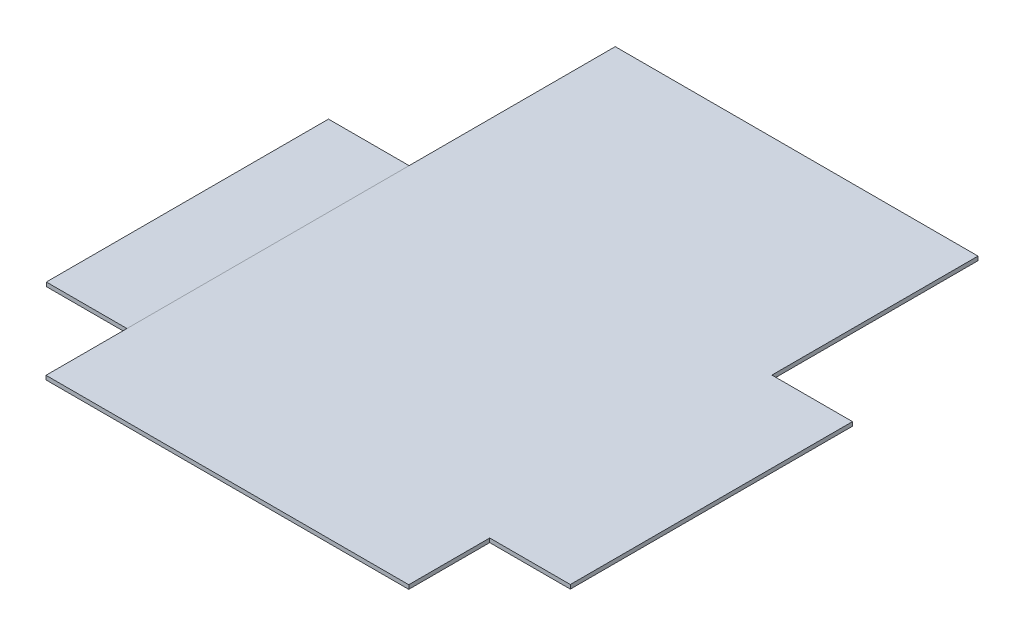
ISO-10303-21;
HEADER;
FILE_DESCRIPTION(('STEP AP214'),'2;1');
FILE_NAME('part.step','',(''),(''),'','','');
FILE_SCHEMA(('AUTOMOTIVE_DESIGN { 1 0 10303 214 1 1 1 1 }'));
ENDSEC;
DATA;
#1=APPLICATION_CONTEXT('core data for automotive mechanical design processes');
#2=APPLICATION_PROTOCOL_DEFINITION('international standard','automotive_design',2000,#1);
#3=PRODUCT_CONTEXT('',#1,'mechanical');
#4=PRODUCT('Part','Part','',(#3));
#5=PRODUCT_RELATED_PRODUCT_CATEGORY('part','',(#4));
#6=PRODUCT_DEFINITION_FORMATION('','',#4);
#7=PRODUCT_DEFINITION_CONTEXT('part definition',#1,'design');
#8=PRODUCT_DEFINITION('design','',#6,#7);
#9=PRODUCT_DEFINITION_SHAPE('','',#8);
#10=(LENGTH_UNIT() NAMED_UNIT(*) SI_UNIT(.MILLI.,.METRE.));
#11=(NAMED_UNIT(*) PLANE_ANGLE_UNIT() SI_UNIT($,.RADIAN.));
#12=(NAMED_UNIT(*) SI_UNIT($,.STERADIAN.) SOLID_ANGLE_UNIT());
#13=UNCERTAINTY_MEASURE_WITH_UNIT(LENGTH_MEASURE(1.E-05),#10,'distance_accuracy_value','');
#14=(GEOMETRIC_REPRESENTATION_CONTEXT(3) GLOBAL_UNCERTAINTY_ASSIGNED_CONTEXT((#13)) GLOBAL_UNIT_ASSIGNED_CONTEXT((#10,
#11,#12)) REPRESENTATION_CONTEXT('',''));
#15=CARTESIAN_POINT('',(0.,0.,0.));
#16=DIRECTION('',(0.,0.,1.));
#17=DIRECTION('',(1.,0.,0.));
#18=AXIS2_PLACEMENT_3D('',#15,#16,#17);
#19=CARTESIAN_POINT('',(-40.,-2.,0.));
#20=DIRECTION('',(0.,0.,-1.));
#21=DIRECTION('',(-1.,0.,0.));
#22=AXIS2_PLACEMENT_3D('',#19,#20,#21);
#23=PLANE('',#22);
#24=DIRECTION('',(0.,1.,0.));
#25=VECTOR('',#24,1.);
#26=CARTESIAN_POINT('',(0.,-2.,0.));
#27=LINE('',#26,#25);
#28=CARTESIAN_POINT('',(0.,-2.,0.));
#29=VERTEX_POINT('',#28);
#30=CARTESIAN_POINT('',(0.,0.,0.));
#31=VERTEX_POINT('',#30);
#32=EDGE_CURVE('E250',#29,#31,#27,.T.);
#33=ORIENTED_EDGE('',*,*,#32,.T.);
#34=DIRECTION('',(1.,0.,0.));
#35=VECTOR('',#34,1.);
#36=CARTESIAN_POINT('',(-40.,0.,0.));
#37=LINE('',#36,#35);
#38=CARTESIAN_POINT('',(-40.,0.,0.));
#39=VERTEX_POINT('',#38);
#40=EDGE_CURVE('E14',#39,#31,#37,.T.);
#41=ORIENTED_EDGE('',*,*,#40,.F.);
#42=DIRECTION('',(0.,1.,0.));
#43=VECTOR('',#42,1.);
#44=CARTESIAN_POINT('',(-40.,-2.,0.));
#45=LINE('',#44,#43);
#46=CARTESIAN_POINT('',(-40.,-2.,0.));
#47=VERTEX_POINT('',#46);
#48=EDGE_CURVE('E238',#47,#39,#45,.T.);
#49=ORIENTED_EDGE('',*,*,#48,.F.);
#50=DIRECTION('',(1.,0.,0.));
#51=VECTOR('',#50,1.);
#52=CARTESIAN_POINT('',(-40.,-2.,0.));
#53=LINE('',#52,#51);
#54=EDGE_CURVE('E246',#47,#29,#53,.T.);
#55=ORIENTED_EDGE('',*,*,#54,.T.);
#56=EDGE_LOOP('',(#33,#41,#49,#55));
#57=FACE_BOUND('',#56,.T.);
#58=ADVANCED_FACE('F187',(#57),#23,.F.);
#59=CARTESIAN_POINT('',(-40.,0.,0.));
#60=DIRECTION('',(0.,-1.,0.));
#61=DIRECTION('',(0.,0.,-1.));
#62=AXIS2_PLACEMENT_3D('',#59,#60,#61);
#63=PLANE('',#62);
#64=DIRECTION('',(0.,0.,-1.));
#65=VECTOR('',#64,1.);
#66=CARTESIAN_POINT('',(0.,0.,0.));
#67=LINE('',#66,#65);
#68=CARTESIAN_POINT('',(0.,0.,-140.));
#69=VERTEX_POINT('',#68);
#70=EDGE_CURVE('E242',#31,#69,#67,.T.);
#71=ORIENTED_EDGE('',*,*,#70,.T.);
#72=DIRECTION('',(1.,0.,0.));
#73=VECTOR('',#72,1.);
#74=CARTESIAN_POINT('',(-40.,0.,-140.));
#75=LINE('',#74,#73);
#76=CARTESIAN_POINT('',(-40.,0.,-140.));
#77=VERTEX_POINT('',#76);
#78=EDGE_CURVE('E195',#77,#69,#75,.T.);
#79=ORIENTED_EDGE('',*,*,#78,.F.);
#80=DIRECTION('',(0.,0.,-1.));
#81=VECTOR('',#80,1.);
#82=CARTESIAN_POINT('',(-40.,0.,0.));
#83=LINE('',#82,#81);
#84=EDGE_CURVE('E233',#39,#77,#83,.T.);
#85=ORIENTED_EDGE('',*,*,#84,.F.);
#86=ORIENTED_EDGE('',*,*,#40,.T.);
#87=EDGE_LOOP('',(#71,#79,#85,#86));
#88=FACE_BOUND('',#87,.T.);
#89=ADVANCED_FACE('F241',(#88),#63,.F.);
#90=CARTESIAN_POINT('',(-40.,0.,-140.));
#91=DIRECTION('',(0.,0.,1.));
#92=DIRECTION('',(1.,0.,0.));
#93=AXIS2_PLACEMENT_3D('',#90,#91,#92);
#94=PLANE('',#93);
#95=DIRECTION('',(0.,-1.,0.));
#96=VECTOR('',#95,1.);
#97=CARTESIAN_POINT('',(0.,0.,-140.));
#98=LINE('',#97,#96);
#99=CARTESIAN_POINT('',(0.,-2.,-140.));
#100=VERTEX_POINT('',#99);
#101=EDGE_CURVE('E220',#69,#100,#98,.T.);
#102=ORIENTED_EDGE('',*,*,#101,.T.);
#103=DIRECTION('',(1.,0.,0.));
#104=VECTOR('',#103,1.);
#105=CARTESIAN_POINT('',(-40.,-2.,-140.));
#106=LINE('',#105,#104);
#107=CARTESIAN_POINT('',(-40.,-2.,-140.));
#108=VERTEX_POINT('',#107);
#109=EDGE_CURVE('E243',#108,#100,#106,.T.);
#110=ORIENTED_EDGE('',*,*,#109,.F.);
#111=DIRECTION('',(0.,-1.,0.));
#112=VECTOR('',#111,1.);
#113=CARTESIAN_POINT('',(-40.,0.,-140.));
#114=LINE('',#113,#112);
#115=EDGE_CURVE('E236',#77,#108,#114,.T.);
#116=ORIENTED_EDGE('',*,*,#115,.F.);
#117=ORIENTED_EDGE('',*,*,#78,.T.);
#118=EDGE_LOOP('',(#102,#110,#116,#117));
#119=FACE_BOUND('',#118,.T.);
#120=ADVANCED_FACE('F244',(#119),#94,.F.);
#121=CARTESIAN_POINT('',(-40.,-2.,-140.));
#122=DIRECTION('',(0.,1.,0.));
#123=DIRECTION('',(0.,0.,1.));
#124=AXIS2_PLACEMENT_3D('',#121,#122,#123);
#125=PLANE('',#124);
#126=DIRECTION('',(0.,0.,1.));
#127=VECTOR('',#126,1.);
#128=CARTESIAN_POINT('',(0.,-2.,-140.));
#129=LINE('',#128,#127);
#130=EDGE_CURVE('E226',#100,#29,#129,.T.);
#131=ORIENTED_EDGE('',*,*,#130,.T.);
#132=ORIENTED_EDGE('',*,*,#54,.F.);
#133=DIRECTION('',(0.,0.,1.));
#134=VECTOR('',#133,1.);
#135=CARTESIAN_POINT('',(-40.,-2.,-140.));
#136=LINE('',#135,#134);
#137=EDGE_CURVE('E203',#108,#47,#136,.T.);
#138=ORIENTED_EDGE('',*,*,#137,.F.);
#139=ORIENTED_EDGE('',*,*,#109,.T.);
#140=EDGE_LOOP('',(#131,#132,#138,#139));
#141=FACE_BOUND('',#140,.T.);
#142=ADVANCED_FACE('F257',(#141),#125,.F.);
#143=CARTESIAN_POINT('',(-40.,0.,0.));
#144=DIRECTION('',(-1.,0.,0.));
#145=DIRECTION('',(0.,0.,1.));
#146=AXIS2_PLACEMENT_3D('',#143,#144,#145);
#147=PLANE('',#146);
#148=ORIENTED_EDGE('',*,*,#48,.T.);
#149=ORIENTED_EDGE('',*,*,#84,.T.);
#150=ORIENTED_EDGE('',*,*,#115,.T.);
#151=ORIENTED_EDGE('',*,*,#137,.T.);
#152=EDGE_LOOP('',(#148,#149,#150,#151));
#153=FACE_BOUND('',#152,.T.);
#154=ADVANCED_FACE('F234',(#153),#147,.T.);
#155=CARTESIAN_POINT('',(0.,0.,0.));
#156=DIRECTION('',(-1.,0.,0.));
#157=DIRECTION('',(0.,0.,1.));
#158=AXIS2_PLACEMENT_3D('',#155,#156,#157);
#159=PLANE('',#158);
#160=ORIENTED_EDGE('',*,*,#32,.F.);
#161=ORIENTED_EDGE('',*,*,#130,.F.);
#162=ORIENTED_EDGE('',*,*,#101,.F.);
#163=ORIENTED_EDGE('',*,*,#70,.F.);
#164=EDGE_LOOP('',(#160,#161,#162,#163));
#165=FACE_BOUND('',#164,.T.);
#166=ADVANCED_FACE('F260',(#165),#159,.F.);
#167=CLOSED_SHELL('',(#58,#89,#120,#142,#154,#166));
#168=MANIFOLD_SOLID_BREP('B2_NOT_SHOWN',#167);
#169=CARTESIAN_POINT('',(0.,-2.00000000000028,-184.991244901112));
#170=DIRECTION('',(1.,0.,0.));
#171=DIRECTION('',(0.,-1.,0.));
#172=AXIS2_PLACEMENT_3D('',#169,#170,#171);
#173=PLANE('',#172);
#174=DIRECTION('',(0.,0.,1.));
#175=VECTOR('',#174,1.);
#176=CARTESIAN_POINT('',(0.,-2.77555756156289E-13,-184.991244901112));
#177=LINE('',#176,#175);
#178=CARTESIAN_POINT('',(0.,2.81025203108243E-13,40.176011873697));
#179=VERTEX_POINT('',#178);
#180=CARTESIAN_POINT('',(0.,-2.77555756156289E-13,-242.27631995365));
#181=VERTEX_POINT('',#180);
#182=EDGE_CURVE('E370',#179,#181,#177,.F.);
#183=ORIENTED_EDGE('',*,*,#182,.T.);
#184=DIRECTION('',(0.,-1.,0.));
#185=VECTOR('',#184,1.);
#186=CARTESIAN_POINT('',(0.,-3.05311331771918E-13,-242.27631995365));
#187=LINE('',#186,#185);
#188=CARTESIAN_POINT('',(0.,-2.00000000000028,-242.27631995365));
#189=VERTEX_POINT('',#188);
#190=EDGE_CURVE('E446',#181,#189,#187,.T.);
#191=ORIENTED_EDGE('',*,*,#190,.T.);
#192=DIRECTION('',(0.,0.,-1.));
#193=VECTOR('',#192,1.);
#194=CARTESIAN_POINT('',(0.,-2.,-141.991244901112));
#195=LINE('',#194,#193);
#196=CARTESIAN_POINT('',(0.,-1.99999999999972,40.176011873697));
#197=VERTEX_POINT('',#196);
#198=EDGE_CURVE('E353',#197,#189,#195,.T.);
#199=ORIENTED_EDGE('',*,*,#198,.F.);
#200=DIRECTION('',(0.,-1.,0.));
#201=VECTOR('',#200,1.);
#202=CARTESIAN_POINT('',(0.,2.74086309204336E-13,40.176011873697));
#203=LINE('',#202,#201);
#204=EDGE_CURVE('E431',#179,#197,#203,.T.);
#205=ORIENTED_EDGE('',*,*,#204,.F.);
#206=EDGE_LOOP('',(#183,#191,#199,#205));
#207=FACE_BOUND('',#206,.T.);
#208=ADVANCED_FACE('F311',(#207),#173,.F.);
#209=CARTESIAN_POINT('',(180.,-2.,-141.991244901112));
#210=DIRECTION('',(-1.,0.,0.));
#211=DIRECTION('',(0.,1.,0.));
#212=AXIS2_PLACEMENT_3D('',#209,#210,#211);
#213=PLANE('',#212);
#214=DIRECTION('',(0.,0.,1.));
#215=VECTOR('',#214,1.);
#216=CARTESIAN_POINT('',(180.,-2.,-141.991244901112));
#217=LINE('',#216,#215);
#218=CARTESIAN_POINT('',(180.,-2.00000000000028,-242.27631995365));
#219=VERTEX_POINT('',#218);
#220=CARTESIAN_POINT('',(180.,-2.,-140.));
#221=VERTEX_POINT('',#220);
#222=EDGE_CURVE('E336',#219,#221,#217,.T.);
#223=ORIENTED_EDGE('',*,*,#222,.F.);
#224=DIRECTION('',(0.,-1.,0.));
#225=VECTOR('',#224,1.);
#226=CARTESIAN_POINT('',(180.,-2.77555756156289E-13,-242.27631995365));
#227=LINE('',#226,#225);
#228=CARTESIAN_POINT('',(180.,-2.77555756156289E-13,-242.27631995365));
#229=VERTEX_POINT('',#228);
#230=EDGE_CURVE('E398',#229,#219,#227,.T.);
#231=ORIENTED_EDGE('',*,*,#230,.F.);
#232=DIRECTION('',(0.,0.,-1.));
#233=VECTOR('',#232,1.);
#234=CARTESIAN_POINT('',(180.,0.,-141.991244901112));
#235=LINE('',#234,#233);
#236=CARTESIAN_POINT('',(180.,0.,-140.));
#237=VERTEX_POINT('',#236);
#238=EDGE_CURVE('E395',#229,#237,#235,.F.);
#239=ORIENTED_EDGE('',*,*,#238,.T.);
#240=DIRECTION('',(0.,1.,0.));
#241=VECTOR('',#240,1.);
#242=CARTESIAN_POINT('',(180.,-2.,-140.));
#243=LINE('',#242,#241);
#244=EDGE_CURVE('E320',#221,#237,#243,.T.);
#245=ORIENTED_EDGE('',*,*,#244,.F.);
#246=EDGE_LOOP('',(#223,#231,#239,#245));
#247=FACE_BOUND('',#246,.T.);
#248=ADVANCED_FACE('F397',(#247),#213,.F.);
#249=CARTESIAN_POINT('',(0.,-2.,-141.991244901112));
#250=DIRECTION('',(0.,1.,0.));
#251=DIRECTION('',(0.,0.,1.));
#252=AXIS2_PLACEMENT_3D('',#249,#250,#251);
#253=PLANE('',#252);
#254=ORIENTED_EDGE('',*,*,#198,.T.);
#255=DIRECTION('',(1.,0.,0.));
#256=VECTOR('',#255,1.);
#257=CARTESIAN_POINT('',(0.,-2.00000000000028,-242.27631995365));
#258=LINE('',#257,#256);
#259=EDGE_CURVE('E440',#219,#189,#258,.F.);
#260=ORIENTED_EDGE('',*,*,#259,.F.);
#261=ORIENTED_EDGE('',*,*,#222,.T.);
#262=DIRECTION('',(1.,0.,0.));
#263=VECTOR('',#262,1.);
#264=CARTESIAN_POINT('',(181.363922450556,-2.,-140.));
#265=LINE('',#264,#263);
#266=CARTESIAN_POINT('',(219.991244901112,-1.99999999999972,-140.));
#267=VERTEX_POINT('',#266);
#268=EDGE_CURVE('E408',#221,#267,#265,.T.);
#269=ORIENTED_EDGE('',*,*,#268,.T.);
#270=DIRECTION('',(0.,0.,1.));
#271=VECTOR('',#270,1.);
#272=CARTESIAN_POINT('',(219.991244901112,-1.99999999999972,-140.));
#273=LINE('',#272,#271);
#274=CARTESIAN_POINT('',(219.991244901112,-1.99999999999972,0.));
#275=VERTEX_POINT('',#274);
#276=EDGE_CURVE('E547',#275,#267,#273,.F.);
#277=ORIENTED_EDGE('',*,*,#276,.F.);
#278=DIRECTION('',(1.,0.,0.));
#279=VECTOR('',#278,1.);
#280=CARTESIAN_POINT('',(181.363922450556,-2.,0.));
#281=LINE('',#280,#279);
#282=CARTESIAN_POINT('',(180.,-2.,0.));
#283=VERTEX_POINT('',#282);
#284=EDGE_CURVE('E392',#275,#283,#281,.F.);
#285=ORIENTED_EDGE('',*,*,#284,.T.);
#286=DIRECTION('',(0.,0.,-1.));
#287=VECTOR('',#286,1.);
#288=CARTESIAN_POINT('',(180.,-2.,0.454640816852004));
#289=LINE('',#288,#287);
#290=CARTESIAN_POINT('',(180.,-1.99999999999973,40.176011873697));
#291=VERTEX_POINT('',#290);
#292=EDGE_CURVE('E376',#283,#291,#289,.F.);
#293=ORIENTED_EDGE('',*,*,#292,.T.);
#294=DIRECTION('',(-1.,0.,0.));
#295=VECTOR('',#294,1.);
#296=CARTESIAN_POINT('',(180.,-1.99999999999973,40.176011873697));
#297=LINE('',#296,#295);
#298=EDGE_CURVE('E435',#197,#291,#297,.F.);
#299=ORIENTED_EDGE('',*,*,#298,.F.);
#300=EDGE_LOOP('',(#254,#260,#261,#269,#277,#285,#293,#299));
#301=FACE_BOUND('',#300,.T.);
#302=ADVANCED_FACE('F461',(#301),#253,.F.);
#303=CARTESIAN_POINT('',(0.,0.,0.));
#304=DIRECTION('',(0.,-1.,0.));
#305=DIRECTION('',(0.,0.,-1.));
#306=AXIS2_PLACEMENT_3D('',#303,#304,#305);
#307=PLANE('',#306);
#308=ORIENTED_EDGE('',*,*,#238,.F.);
#309=DIRECTION('',(-1.,0.,0.));
#310=VECTOR('',#309,1.);
#311=CARTESIAN_POINT('',(0.,-2.77555756156289E-13,-242.27631995365));
#312=LINE('',#311,#310);
#313=EDGE_CURVE('E443',#229,#181,#312,.T.);
#314=ORIENTED_EDGE('',*,*,#313,.T.);
#315=ORIENTED_EDGE('',*,*,#182,.F.);
#316=DIRECTION('',(1.,0.,0.));
#317=VECTOR('',#316,1.);
#318=CARTESIAN_POINT('',(0.,2.81025203108243E-13,40.176011873697));
#319=LINE('',#318,#317);
#320=CARTESIAN_POINT('',(180.,2.74086309204336E-13,40.176011873697));
#321=VERTEX_POINT('',#320);
#322=EDGE_CURVE('E423',#179,#321,#319,.T.);
#323=ORIENTED_EDGE('',*,*,#322,.T.);
#324=DIRECTION('',(0.,0.,-1.));
#325=VECTOR('',#324,1.);
#326=CARTESIAN_POINT('',(180.,0.,0.454640816852004));
#327=LINE('',#326,#325);
#328=CARTESIAN_POINT('',(180.,0.,0.));
#329=VERTEX_POINT('',#328);
#330=EDGE_CURVE('E426',#329,#321,#327,.F.);
#331=ORIENTED_EDGE('',*,*,#330,.F.);
#332=DIRECTION('',(1.,0.,0.));
#333=VECTOR('',#332,1.);
#334=CARTESIAN_POINT('',(181.363922450556,0.,0.));
#335=LINE('',#334,#333);
#336=CARTESIAN_POINT('',(219.991244901112,2.77555756156289E-13,0.));
#337=VERTEX_POINT('',#336);
#338=EDGE_CURVE('E327',#337,#329,#335,.F.);
#339=ORIENTED_EDGE('',*,*,#338,.F.);
#340=DIRECTION('',(0.,0.,-1.));
#341=VECTOR('',#340,1.);
#342=CARTESIAN_POINT('',(219.991244901112,2.77555756156289E-13,0.));
#343=LINE('',#342,#341);
#344=CARTESIAN_POINT('',(219.991244901112,2.77555756156289E-13,-140.));
#345=VERTEX_POINT('',#344);
#346=EDGE_CURVE('E411',#337,#345,#343,.T.);
#347=ORIENTED_EDGE('',*,*,#346,.T.);
#348=DIRECTION('',(1.,0.,0.));
#349=VECTOR('',#348,1.);
#350=CARTESIAN_POINT('',(181.363922450556,0.,-140.));
#351=LINE('',#350,#349);
#352=EDGE_CURVE('E406',#237,#345,#351,.T.);
#353=ORIENTED_EDGE('',*,*,#352,.F.);
#354=EDGE_LOOP('',(#308,#314,#315,#323,#331,#339,#347,#353));
#355=FACE_BOUND('',#354,.T.);
#356=ADVANCED_FACE('F313',(#355),#307,.F.);
#357=CARTESIAN_POINT('',(0.,-2.77555756156289E-13,-242.27631995365));
#358=DIRECTION('',(0.,0.,1.));
#359=DIRECTION('',(0.,-1.,0.));
#360=AXIS2_PLACEMENT_3D('',#357,#358,#359);
#361=PLANE('',#360);
#362=ORIENTED_EDGE('',*,*,#259,.T.);
#363=ORIENTED_EDGE('',*,*,#190,.F.);
#364=ORIENTED_EDGE('',*,*,#313,.F.);
#365=ORIENTED_EDGE('',*,*,#230,.T.);
#366=EDGE_LOOP('',(#362,#363,#364,#365));
#367=FACE_BOUND('',#366,.T.);
#368=ADVANCED_FACE('F460',(#367),#361,.F.);
#369=CARTESIAN_POINT('',(180.,-1.,0.454640816852004));
#370=DIRECTION('',(-1.,0.,0.));
#371=DIRECTION('',(0.,0.,-1.));
#372=AXIS2_PLACEMENT_3D('',#369,#370,#371);
#373=PLANE('',#372);
#374=DIRECTION('',(0.,1.,0.));
#375=VECTOR('',#374,1.);
#376=CARTESIAN_POINT('',(180.,-2.,0.));
#377=LINE('',#376,#375);
#378=EDGE_CURVE('E185',#283,#329,#377,.T.);
#379=ORIENTED_EDGE('',*,*,#378,.T.);
#380=ORIENTED_EDGE('',*,*,#330,.T.);
#381=DIRECTION('',(0.,-1.,0.));
#382=VECTOR('',#381,1.);
#383=CARTESIAN_POINT('',(180.,2.77555756156289E-13,40.176011873697));
#384=LINE('',#383,#382);
#385=EDGE_CURVE('E427',#321,#291,#384,.T.);
#386=ORIENTED_EDGE('',*,*,#385,.T.);
#387=ORIENTED_EDGE('',*,*,#292,.F.);
#388=EDGE_LOOP('',(#379,#380,#386,#387));
#389=FACE_BOUND('',#388,.T.);
#390=ADVANCED_FACE('F507',(#389),#373,.F.);
#391=CARTESIAN_POINT('',(180.,2.70616862252382E-13,40.176011873697));
#392=DIRECTION('',(0.,0.,-1.));
#393=DIRECTION('',(0.,1.,0.));
#394=AXIS2_PLACEMENT_3D('',#391,#392,#393);
#395=PLANE('',#394);
#396=ORIENTED_EDGE('',*,*,#298,.T.);
#397=ORIENTED_EDGE('',*,*,#385,.F.);
#398=ORIENTED_EDGE('',*,*,#322,.F.);
#399=ORIENTED_EDGE('',*,*,#204,.T.);
#400=EDGE_LOOP('',(#396,#397,#398,#399));
#401=FACE_BOUND('',#400,.T.);
#402=ADVANCED_FACE('F513',(#401),#395,.F.);
#403=CARTESIAN_POINT('',(181.363922450556,-1.,-140.));
#404=DIRECTION('',(0.,0.,-1.));
#405=DIRECTION('',(1.,0.,0.));
#406=AXIS2_PLACEMENT_3D('',#403,#404,#405);
#407=PLANE('',#406);
#408=ORIENTED_EDGE('',*,*,#244,.T.);
#409=ORIENTED_EDGE('',*,*,#352,.T.);
#410=DIRECTION('',(0.,-1.,0.));
#411=VECTOR('',#410,1.);
#412=CARTESIAN_POINT('',(219.991244901112,2.77555756156289E-13,-140.));
#413=LINE('',#412,#411);
#414=EDGE_CURVE('E418',#345,#267,#413,.T.);
#415=ORIENTED_EDGE('',*,*,#414,.T.);
#416=ORIENTED_EDGE('',*,*,#268,.F.);
#417=EDGE_LOOP('',(#408,#409,#415,#416));
#418=FACE_BOUND('',#417,.T.);
#419=ADVANCED_FACE('F404',(#418),#407,.T.);
#420=CARTESIAN_POINT('',(181.363922450556,-1.,0.));
#421=DIRECTION('',(0.,0.,-1.));
#422=DIRECTION('',(1.,0.,0.));
#423=AXIS2_PLACEMENT_3D('',#420,#421,#422);
#424=PLANE('',#423);
#425=ORIENTED_EDGE('',*,*,#338,.T.);
#426=ORIENTED_EDGE('',*,*,#378,.F.);
#427=ORIENTED_EDGE('',*,*,#284,.F.);
#428=DIRECTION('',(0.,-1.,0.));
#429=VECTOR('',#428,1.);
#430=CARTESIAN_POINT('',(219.991244901112,2.77555756156289E-13,0.));
#431=LINE('',#430,#429);
#432=EDGE_CURVE('E548',#337,#275,#431,.T.);
#433=ORIENTED_EDGE('',*,*,#432,.F.);
#434=EDGE_LOOP('',(#425,#426,#427,#433));
#435=FACE_BOUND('',#434,.T.);
#436=ADVANCED_FACE('F530',(#435),#424,.F.);
#437=CARTESIAN_POINT('',(219.991244901112,2.77555756156289E-13,-140.));
#438=DIRECTION('',(-1.,0.,0.));
#439=DIRECTION('',(0.,-1.,0.));
#440=AXIS2_PLACEMENT_3D('',#437,#438,#439);
#441=PLANE('',#440);
#442=ORIENTED_EDGE('',*,*,#276,.T.);
#443=ORIENTED_EDGE('',*,*,#414,.F.);
#444=ORIENTED_EDGE('',*,*,#346,.F.);
#445=ORIENTED_EDGE('',*,*,#432,.T.);
#446=EDGE_LOOP('',(#442,#443,#444,#445));
#447=FACE_BOUND('',#446,.T.);
#448=ADVANCED_FACE('F477',(#447),#441,.F.);
#449=CLOSED_SHELL('',(#208,#248,#302,#356,#368,#390,#402,#419,#436,#448));
#450=MANIFOLD_SOLID_BREP('B8',#449);
#451=ADVANCED_BREP_SHAPE_REPRESENTATION('',(#18,#168,#450),#14);
#452=SHAPE_DEFINITION_REPRESENTATION(#9,#451);
ENDSEC;
END-ISO-10303-21;
